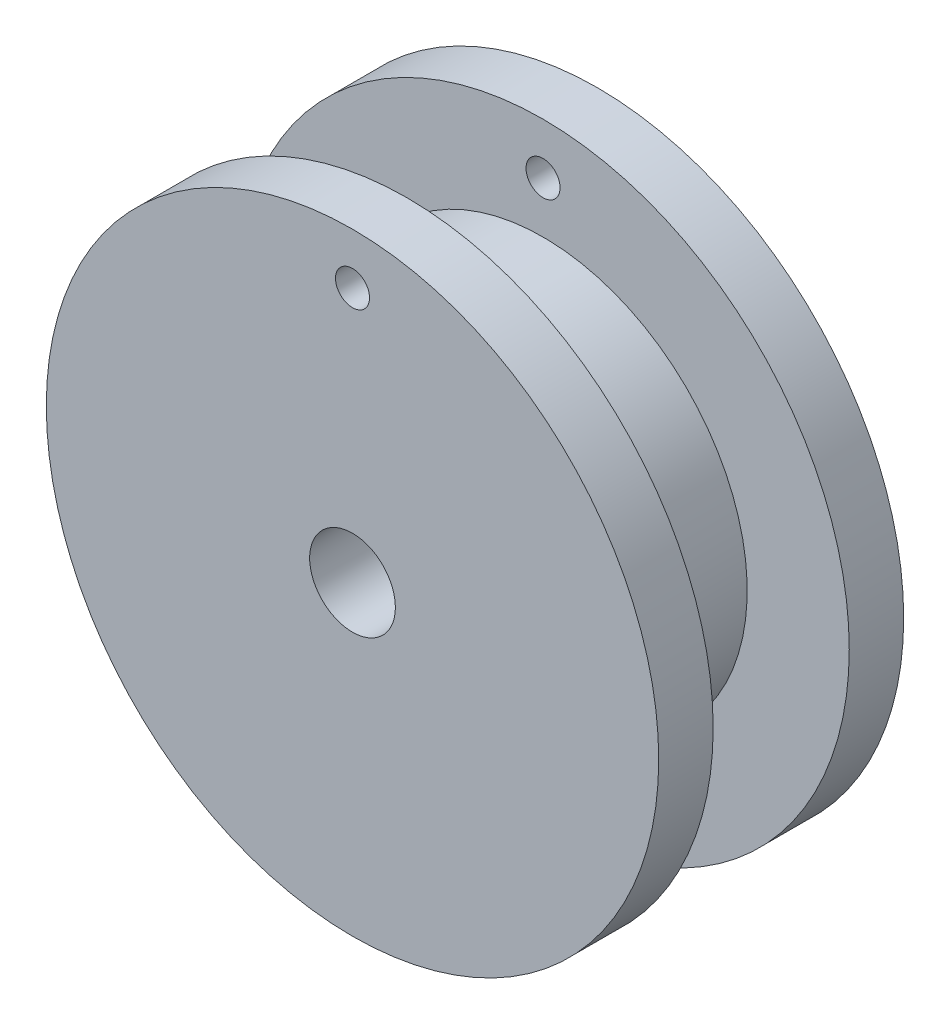
ISO-10303-21;
HEADER;
FILE_DESCRIPTION(('STEP AP214'),'2;1');
FILE_NAME('part.step','',(''),(''),'','','');
FILE_SCHEMA(('AUTOMOTIVE_DESIGN { 1 0 10303 214 1 1 1 1 }'));
ENDSEC;
DATA;
#1=APPLICATION_CONTEXT('core data for automotive mechanical design processes');
#2=APPLICATION_PROTOCOL_DEFINITION('international standard','automotive_design',2000,#1);
#3=PRODUCT_CONTEXT('',#1,'mechanical');
#4=PRODUCT('Part','Part','',(#3));
#5=PRODUCT_RELATED_PRODUCT_CATEGORY('part','',(#4));
#6=PRODUCT_DEFINITION_FORMATION('','',#4);
#7=PRODUCT_DEFINITION_CONTEXT('part definition',#1,'design');
#8=PRODUCT_DEFINITION('design','',#6,#7);
#9=PRODUCT_DEFINITION_SHAPE('','',#8);
#10=(LENGTH_UNIT() NAMED_UNIT(*) SI_UNIT(.MILLI.,.METRE.));
#11=(NAMED_UNIT(*) PLANE_ANGLE_UNIT() SI_UNIT($,.RADIAN.));
#12=(NAMED_UNIT(*) SI_UNIT($,.STERADIAN.) SOLID_ANGLE_UNIT());
#13=UNCERTAINTY_MEASURE_WITH_UNIT(LENGTH_MEASURE(1.E-05),#10,'distance_accuracy_value','');
#14=(GEOMETRIC_REPRESENTATION_CONTEXT(3) GLOBAL_UNCERTAINTY_ASSIGNED_CONTEXT((#13)) GLOBAL_UNIT_ASSIGNED_CONTEXT((#10,
#11,#12)) REPRESENTATION_CONTEXT('',''));
#15=CARTESIAN_POINT('',(0.,0.,0.));
#16=DIRECTION('',(0.,0.,1.));
#17=DIRECTION('',(1.,0.,0.));
#18=AXIS2_PLACEMENT_3D('',#15,#16,#17);
#19=CARTESIAN_POINT('',(0.,0.,6.35));
#20=DIRECTION('',(0.,0.,-1.));
#21=DIRECTION('',(-1.,0.,0.));
#22=AXIS2_PLACEMENT_3D('',#19,#20,#21);
#23=CYLINDRICAL_SURFACE('',#22,9.525);
#24=CARTESIAN_POINT('',(0.,0.,6.35));
#25=DIRECTION('',(0.,0.,1.));
#26=DIRECTION('',(1.,0.,0.));
#27=AXIS2_PLACEMENT_3D('',#24,#25,#26);
#28=CIRCLE('',#27,9.525);
#29=CARTESIAN_POINT('',(9.525,0.,6.35));
#30=VERTEX_POINT('',#29);
#31=EDGE_CURVE('E10',#30,#30,#28,.T.);
#32=ORIENTED_EDGE('',*,*,#31,.F.);
#33=EDGE_LOOP('',(#32));
#34=FACE_BOUND('',#33,.T.);
#35=CARTESIAN_POINT('',(0.,0.,0.));
#36=DIRECTION('',(0.,0.,-1.));
#37=DIRECTION('',(-1.,0.,0.));
#38=AXIS2_PLACEMENT_3D('',#35,#36,#37);
#39=CIRCLE('',#38,9.525);
#40=CARTESIAN_POINT('',(-9.525,0.,0.));
#41=VERTEX_POINT('',#40);
#42=EDGE_CURVE('E50',#41,#41,#39,.T.);
#43=ORIENTED_EDGE('',*,*,#42,.F.);
#44=EDGE_LOOP('',(#43));
#45=FACE_BOUND('',#44,.T.);
#46=ADVANCED_FACE('F31',(#34,#45),#23,.T.);
#47=CARTESIAN_POINT('',(0.,0.,0.));
#48=DIRECTION('',(0.,0.,1.));
#49=DIRECTION('',(1.,0.,0.));
#50=AXIS2_PLACEMENT_3D('',#47,#48,#49);
#51=CYLINDRICAL_SURFACE('',#50,2.);
#52=CARTESIAN_POINT('',(0.,0.,8.89));
#53=DIRECTION('',(0.,0.,1.));
#54=DIRECTION('',(1.,0.,0.));
#55=AXIS2_PLACEMENT_3D('',#52,#53,#54);
#56=CIRCLE('',#55,2.);
#57=CARTESIAN_POINT('',(2.,0.,8.89));
#58=VERTEX_POINT('',#57);
#59=EDGE_CURVE('E46',#58,#58,#56,.T.);
#60=ORIENTED_EDGE('',*,*,#59,.T.);
#61=EDGE_LOOP('',(#60));
#62=FACE_BOUND('',#61,.T.);
#63=CARTESIAN_POINT('',(0.,0.,-2.54));
#64=DIRECTION('',(0.,0.,-1.));
#65=DIRECTION('',(-1.,0.,0.));
#66=AXIS2_PLACEMENT_3D('',#63,#64,#65);
#67=CIRCLE('',#66,2.);
#68=CARTESIAN_POINT('',(-2.,0.,-2.54));
#69=VERTEX_POINT('',#68);
#70=EDGE_CURVE('E57',#69,#69,#67,.T.);
#71=ORIENTED_EDGE('',*,*,#70,.T.);
#72=EDGE_LOOP('',(#71));
#73=FACE_BOUND('',#72,.T.);
#74=ADVANCED_FACE('F96',(#62,#73),#51,.F.);
#75=CARTESIAN_POINT('',(0.,0.,6.35));
#76=DIRECTION('',(0.,0.,1.));
#77=DIRECTION('',(1.,0.,0.));
#78=AXIS2_PLACEMENT_3D('',#75,#76,#77);
#79=PLANE('',#78);
#80=CARTESIAN_POINT('',(0.,11.90625,6.35));
#81=DIRECTION('',(0.,0.,1.));
#82=DIRECTION('',(1.,0.,0.));
#83=AXIS2_PLACEMENT_3D('',#80,#81,#82);
#84=CIRCLE('',#83,0.793749999999999);
#85=CARTESIAN_POINT('',(0.793749999999999,11.90625,6.35));
#86=VERTEX_POINT('',#85);
#87=EDGE_CURVE('E62',#86,#86,#84,.T.);
#88=ORIENTED_EDGE('',*,*,#87,.T.);
#89=EDGE_LOOP('',(#88));
#90=FACE_BOUND('',#89,.T.);
#91=CARTESIAN_POINT('',(0.,0.,6.35));
#92=DIRECTION('',(0.,0.,1.));
#93=DIRECTION('',(1.,0.,0.));
#94=AXIS2_PLACEMENT_3D('',#91,#92,#93);
#95=CIRCLE('',#94,14.2875);
#96=CARTESIAN_POINT('',(14.2875,0.,6.35));
#97=VERTEX_POINT('',#96);
#98=EDGE_CURVE('E41',#97,#97,#95,.T.);
#99=ORIENTED_EDGE('',*,*,#98,.F.);
#100=EDGE_LOOP('',(#99));
#101=FACE_BOUND('',#100,.T.);
#102=ORIENTED_EDGE('',*,*,#31,.T.);
#103=EDGE_LOOP('',(#102));
#104=FACE_BOUND('',#103,.T.);
#105=ADVANCED_FACE('F101',(#90,#101,#104),#79,.F.);
#106=CARTESIAN_POINT('',(0.,0.,8.89));
#107=DIRECTION('',(0.,0.,1.));
#108=DIRECTION('',(1.,0.,0.));
#109=AXIS2_PLACEMENT_3D('',#106,#107,#108);
#110=PLANE('',#109);
#111=CARTESIAN_POINT('',(0.,11.90625,8.89));
#112=DIRECTION('',(0.,0.,1.));
#113=DIRECTION('',(1.,0.,0.));
#114=AXIS2_PLACEMENT_3D('',#111,#112,#113);
#115=CIRCLE('',#114,0.793749999999999);
#116=CARTESIAN_POINT('',(0.793749999999999,11.90625,8.89));
#117=VERTEX_POINT('',#116);
#118=EDGE_CURVE('E69',#117,#117,#115,.T.);
#119=ORIENTED_EDGE('',*,*,#118,.F.);
#120=EDGE_LOOP('',(#119));
#121=FACE_BOUND('',#120,.T.);
#122=CARTESIAN_POINT('',(0.,0.,8.89));
#123=DIRECTION('',(0.,0.,1.));
#124=DIRECTION('',(1.,0.,0.));
#125=AXIS2_PLACEMENT_3D('',#122,#123,#124);
#126=CIRCLE('',#125,14.2875);
#127=CARTESIAN_POINT('',(14.2875,0.,8.89));
#128=VERTEX_POINT('',#127);
#129=EDGE_CURVE('E37',#128,#128,#126,.T.);
#130=ORIENTED_EDGE('',*,*,#129,.T.);
#131=EDGE_LOOP('',(#130));
#132=FACE_BOUND('',#131,.T.);
#133=ORIENTED_EDGE('',*,*,#59,.F.);
#134=EDGE_LOOP('',(#133));
#135=FACE_BOUND('',#134,.T.);
#136=ADVANCED_FACE('F106',(#121,#132,#135),#110,.T.);
#137=CARTESIAN_POINT('',(0.,0.,8.89));
#138=DIRECTION('',(0.,0.,-1.));
#139=DIRECTION('',(-1.,0.,0.));
#140=AXIS2_PLACEMENT_3D('',#137,#138,#139);
#141=CYLINDRICAL_SURFACE('',#140,14.2875);
#142=ORIENTED_EDGE('',*,*,#129,.F.);
#143=EDGE_LOOP('',(#142));
#144=FACE_BOUND('',#143,.T.);
#145=ORIENTED_EDGE('',*,*,#98,.T.);
#146=EDGE_LOOP('',(#145));
#147=FACE_BOUND('',#146,.T.);
#148=ADVANCED_FACE('F89',(#144,#147),#141,.T.);
#149=CARTESIAN_POINT('',(0.,0.,0.));
#150=DIRECTION('',(0.,0.,-1.));
#151=DIRECTION('',(-1.,0.,0.));
#152=AXIS2_PLACEMENT_3D('',#149,#150,#151);
#153=PLANE('',#152);
#154=CARTESIAN_POINT('',(0.,11.90625,0.));
#155=DIRECTION('',(0.,0.,-1.));
#156=DIRECTION('',(-1.,0.,0.));
#157=AXIS2_PLACEMENT_3D('',#154,#155,#156);
#158=CIRCLE('',#157,0.793749999999999);
#159=CARTESIAN_POINT('',(-0.793749999999999,11.90625,0.));
#160=VERTEX_POINT('',#159);
#161=EDGE_CURVE('E65',#160,#160,#158,.T.);
#162=ORIENTED_EDGE('',*,*,#161,.T.);
#163=EDGE_LOOP('',(#162));
#164=FACE_BOUND('',#163,.T.);
#165=CARTESIAN_POINT('',(0.,0.,0.));
#166=DIRECTION('',(0.,0.,-1.));
#167=DIRECTION('',(-1.,0.,0.));
#168=AXIS2_PLACEMENT_3D('',#165,#166,#167);
#169=CIRCLE('',#168,14.2875);
#170=CARTESIAN_POINT('',(-14.2875,0.,0.));
#171=VERTEX_POINT('',#170);
#172=EDGE_CURVE('E54',#171,#171,#169,.T.);
#173=ORIENTED_EDGE('',*,*,#172,.F.);
#174=EDGE_LOOP('',(#173));
#175=FACE_BOUND('',#174,.T.);
#176=ORIENTED_EDGE('',*,*,#42,.T.);
#177=EDGE_LOOP('',(#176));
#178=FACE_BOUND('',#177,.T.);
#179=ADVANCED_FACE('F86',(#164,#175,#178),#153,.F.);
#180=CARTESIAN_POINT('',(0.,0.,-2.54));
#181=DIRECTION('',(0.,0.,-1.));
#182=DIRECTION('',(-1.,0.,0.));
#183=AXIS2_PLACEMENT_3D('',#180,#181,#182);
#184=PLANE('',#183);
#185=CARTESIAN_POINT('',(0.,11.90625,-2.54));
#186=DIRECTION('',(0.,0.,1.));
#187=DIRECTION('',(1.,0.,0.));
#188=AXIS2_PLACEMENT_3D('',#185,#186,#187);
#189=CIRCLE('',#188,0.793749999999999);
#190=CARTESIAN_POINT('',(0.793749999999999,11.90625,-2.54));
#191=VERTEX_POINT('',#190);
#192=EDGE_CURVE('E68',#191,#191,#189,.T.);
#193=ORIENTED_EDGE('',*,*,#192,.T.);
#194=EDGE_LOOP('',(#193));
#195=FACE_BOUND('',#194,.T.);
#196=CARTESIAN_POINT('',(0.,0.,-2.54));
#197=DIRECTION('',(0.,0.,-1.));
#198=DIRECTION('',(-1.,0.,0.));
#199=AXIS2_PLACEMENT_3D('',#196,#197,#198);
#200=CIRCLE('',#199,14.2875);
#201=CARTESIAN_POINT('',(-14.2875,0.,-2.54));
#202=VERTEX_POINT('',#201);
#203=EDGE_CURVE('E53',#202,#202,#200,.T.);
#204=ORIENTED_EDGE('',*,*,#203,.T.);
#205=EDGE_LOOP('',(#204));
#206=FACE_BOUND('',#205,.T.);
#207=ORIENTED_EDGE('',*,*,#70,.F.);
#208=EDGE_LOOP('',(#207));
#209=FACE_BOUND('',#208,.T.);
#210=ADVANCED_FACE('F75',(#195,#206,#209),#184,.T.);
#211=CARTESIAN_POINT('',(0.,0.,-2.54));
#212=DIRECTION('',(0.,0.,1.));
#213=DIRECTION('',(1.,0.,0.));
#214=AXIS2_PLACEMENT_3D('',#211,#212,#213);
#215=CYLINDRICAL_SURFACE('',#214,14.2875);
#216=ORIENTED_EDGE('',*,*,#203,.F.);
#217=EDGE_LOOP('',(#216));
#218=FACE_BOUND('',#217,.T.);
#219=ORIENTED_EDGE('',*,*,#172,.T.);
#220=EDGE_LOOP('',(#219));
#221=FACE_BOUND('',#220,.T.);
#222=ADVANCED_FACE('F82',(#218,#221),#215,.T.);
#223=CARTESIAN_POINT('',(0.,11.90625,-2.54));
#224=DIRECTION('',(0.,0.,1.));
#225=DIRECTION('',(1.,0.,0.));
#226=AXIS2_PLACEMENT_3D('',#223,#224,#225);
#227=CYLINDRICAL_SURFACE('',#226,0.793749999999999);
#228=ORIENTED_EDGE('',*,*,#192,.F.);
#229=EDGE_LOOP('',(#228));
#230=FACE_BOUND('',#229,.T.);
#231=ORIENTED_EDGE('',*,*,#161,.F.);
#232=EDGE_LOOP('',(#231));
#233=FACE_BOUND('',#232,.T.);
#234=ADVANCED_FACE('F78',(#230,#233),#227,.F.);
#235=ORIENTED_EDGE('',*,*,#118,.T.);
#236=EDGE_LOOP('',(#235));
#237=FACE_BOUND('',#236,.T.);
#238=ORIENTED_EDGE('',*,*,#87,.F.);
#239=EDGE_LOOP('',(#238));
#240=FACE_BOUND('',#239,.T.);
#241=ADVANCED_FACE('F81',(#237,#240),#227,.F.);
#242=CLOSED_SHELL('',(#46,#74,#105,#136,#148,#179,#210,#222,#234,#241));
#243=MANIFOLD_SOLID_BREP('B2',#242);
#244=ADVANCED_BREP_SHAPE_REPRESENTATION('',(#18,#243),#14);
#245=SHAPE_DEFINITION_REPRESENTATION(#9,#244);
ENDSEC;
END-ISO-10303-21;
